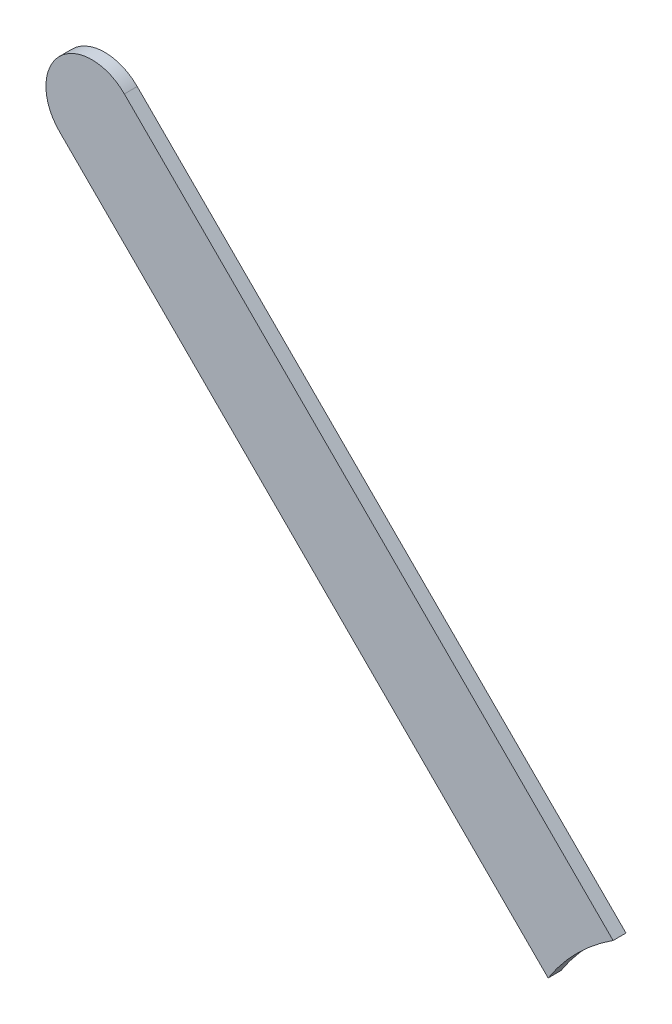
ISO-10303-21;
HEADER;
FILE_DESCRIPTION(('STEP AP214'),'2;1');
FILE_NAME('part.step','',(''),(''),'','','');
FILE_SCHEMA(('AUTOMOTIVE_DESIGN { 1 0 10303 214 1 1 1 1 }'));
ENDSEC;
DATA;
#1=APPLICATION_CONTEXT('core data for automotive mechanical design processes');
#2=APPLICATION_PROTOCOL_DEFINITION('international standard','automotive_design',2000,#1);
#3=PRODUCT_CONTEXT('',#1,'mechanical');
#4=PRODUCT('Part','Part','',(#3));
#5=PRODUCT_RELATED_PRODUCT_CATEGORY('part','',(#4));
#6=PRODUCT_DEFINITION_FORMATION('','',#4);
#7=PRODUCT_DEFINITION_CONTEXT('part definition',#1,'design');
#8=PRODUCT_DEFINITION('design','',#6,#7);
#9=PRODUCT_DEFINITION_SHAPE('','',#8);
#10=(LENGTH_UNIT() NAMED_UNIT(*) SI_UNIT(.MILLI.,.METRE.));
#11=(NAMED_UNIT(*) PLANE_ANGLE_UNIT() SI_UNIT($,.RADIAN.));
#12=(NAMED_UNIT(*) SI_UNIT($,.STERADIAN.) SOLID_ANGLE_UNIT());
#13=UNCERTAINTY_MEASURE_WITH_UNIT(LENGTH_MEASURE(1.E-05),#10,'distance_accuracy_value','');
#14=(GEOMETRIC_REPRESENTATION_CONTEXT(3) GLOBAL_UNCERTAINTY_ASSIGNED_CONTEXT((#13)) GLOBAL_UNIT_ASSIGNED_CONTEXT((#10,
#11,#12)) REPRESENTATION_CONTEXT('',''));
#15=CARTESIAN_POINT('',(0.,0.,0.));
#16=DIRECTION('',(0.,0.,1.));
#17=DIRECTION('',(1.,0.,0.));
#18=AXIS2_PLACEMENT_3D('',#15,#16,#17);
#19=CARTESIAN_POINT('',(94.64332354,105.29716812,0.));
#20=DIRECTION('',(0.707106781186548,0.707106781186548,0.));
#21=DIRECTION('',(0.707106781186548,-0.707106781186548,0.));
#22=AXIS2_PLACEMENT_3D('',#19,#20,#21);
#23=PLANE('',#22);
#24=DIRECTION('',(0.707106781186548,-0.707106781186548,0.));
#25=VECTOR('',#24,1.);
#26=CARTESIAN_POINT('',(94.64332354,105.29716812,0.03556));
#27=LINE('',#26,#25);
#28=CARTESIAN_POINT('',(94.64332354,105.29716812,0.03556));
#29=VERTEX_POINT('',#28);
#30=CARTESIAN_POINT('',(95.9945262160068,103.945965443993,0.03556));
#31=VERTEX_POINT('',#30);
#32=EDGE_CURVE('E11',#29,#31,#27,.T.);
#33=ORIENTED_EDGE('',*,*,#32,.F.);
#34=DIRECTION('',(0.,0.,1.));
#35=VECTOR('',#34,1.);
#36=CARTESIAN_POINT('',(94.64332354,105.29716812,0.));
#37=LINE('',#36,#35);
#38=CARTESIAN_POINT('',(94.64332354,105.29716812,0.));
#39=VERTEX_POINT('',#38);
#40=EDGE_CURVE('E24',#39,#29,#37,.T.);
#41=ORIENTED_EDGE('',*,*,#40,.F.);
#42=DIRECTION('',(0.707106781186548,-0.707106781186548,0.));
#43=VECTOR('',#42,1.);
#44=CARTESIAN_POINT('',(94.64332354,105.29716812,0.));
#45=LINE('',#44,#43);
#46=CARTESIAN_POINT('',(95.9945262160068,103.945965443993,0.));
#47=VERTEX_POINT('',#46);
#48=EDGE_CURVE('E75',#39,#47,#45,.T.);
#49=ORIENTED_EDGE('',*,*,#48,.T.);
#50=DIRECTION('',(0.,0.,1.));
#51=VECTOR('',#50,1.);
#52=CARTESIAN_POINT('',(95.9945262160068,103.945965443993,0.));
#53=LINE('',#52,#51);
#54=EDGE_CURVE('E37',#47,#31,#53,.T.);
#55=ORIENTED_EDGE('',*,*,#54,.T.);
#56=EDGE_LOOP('',(#33,#41,#49,#55));
#57=FACE_BOUND('',#56,.T.);
#58=ADVANCED_FACE('F17',(#57),#23,.F.);
#59=CARTESIAN_POINT('',(96.495362,103.6247356,0.));
#60=DIRECTION('',(0.,0.,-1.));
#61=DIRECTION('',(1.,0.,0.));
#62=AXIS2_PLACEMENT_3D('',#59,#60,#61);
#63=CYLINDRICAL_SURFACE('',#62,0.59500008);
#64=DIRECTION('',(0.,0.,1.));
#65=VECTOR('',#64,1.);
#66=CARTESIAN_POINT('',(96.1741321560068,104.125571383993,0.));
#67=LINE('',#66,#65);
#68=CARTESIAN_POINT('',(96.1741321560068,104.125571383993,0.));
#69=VERTEX_POINT('',#68);
#70=CARTESIAN_POINT('',(96.1741321560068,104.125571383993,0.03556));
#71=VERTEX_POINT('',#70);
#72=EDGE_CURVE('E67',#69,#71,#67,.T.);
#73=ORIENTED_EDGE('',*,*,#72,.T.);
#74=CARTESIAN_POINT('',(96.495362,103.6247356,0.03556));
#75=DIRECTION('',(0.,0.,1.));
#76=DIRECTION('',(1.,0.,0.));
#77=AXIS2_PLACEMENT_3D('',#74,#75,#76);
#78=CIRCLE('',#77,0.59500008);
#79=EDGE_CURVE('E82',#71,#31,#78,.T.);
#80=ORIENTED_EDGE('',*,*,#79,.T.);
#81=ORIENTED_EDGE('',*,*,#54,.F.);
#82=CARTESIAN_POINT('',(96.495362,103.6247356,0.));
#83=DIRECTION('',(0.,0.,1.));
#84=DIRECTION('',(1.,0.,0.));
#85=AXIS2_PLACEMENT_3D('',#82,#83,#84);
#86=CIRCLE('',#85,0.59500008);
#87=EDGE_CURVE('E80',#69,#47,#86,.T.);
#88=ORIENTED_EDGE('',*,*,#87,.F.);
#89=EDGE_LOOP('',(#73,#80,#81,#88));
#90=FACE_BOUND('',#89,.T.);
#91=ADVANCED_FACE('F88',(#90),#63,.F.);
#92=CARTESIAN_POINT('',(96.1741321560068,104.125571383993,0.));
#93=DIRECTION('',(-0.707106781186545,-0.70710678118655,0.));
#94=DIRECTION('',(-0.70710678118655,0.707106781186545,0.));
#95=AXIS2_PLACEMENT_3D('',#92,#93,#94);
#96=PLANE('',#95);
#97=DIRECTION('',(-0.70710678118655,0.707106781186545,0.));
#98=VECTOR('',#97,1.);
#99=CARTESIAN_POINT('',(96.5851637,103.71453984,0.03556));
#100=LINE('',#99,#98);
#101=CARTESIAN_POINT('',(94.82292948,105.47677406,0.03556));
#102=VERTEX_POINT('',#101);
#103=EDGE_CURVE('E71',#71,#102,#100,.T.);
#104=ORIENTED_EDGE('',*,*,#103,.F.);
#105=ORIENTED_EDGE('',*,*,#72,.F.);
#106=DIRECTION('',(-0.70710678118655,0.707106781186545,0.));
#107=VECTOR('',#106,1.);
#108=CARTESIAN_POINT('',(96.5851637,103.71453984,0.));
#109=LINE('',#108,#107);
#110=CARTESIAN_POINT('',(94.82292948,105.47677406,0.));
#111=VERTEX_POINT('',#110);
#112=EDGE_CURVE('E63',#69,#111,#109,.T.);
#113=ORIENTED_EDGE('',*,*,#112,.T.);
#114=DIRECTION('',(0.,0.,1.));
#115=VECTOR('',#114,1.);
#116=CARTESIAN_POINT('',(94.82292948,105.47677406,0.));
#117=LINE('',#116,#115);
#118=EDGE_CURVE('E53',#111,#102,#117,.T.);
#119=ORIENTED_EDGE('',*,*,#118,.T.);
#120=EDGE_LOOP('',(#104,#105,#113,#119));
#121=FACE_BOUND('',#120,.T.);
#122=ADVANCED_FACE('F66',(#121),#96,.F.);
#123=CARTESIAN_POINT('',(94.73312651,105.38697109,0.));
#124=DIRECTION('',(0.,0.,-1.));
#125=DIRECTION('',(0.707106781186548,0.707106781186548,0.));
#126=AXIS2_PLACEMENT_3D('',#123,#124,#125);
#127=CYLINDRICAL_SURFACE('',#126,0.127000578115379);
#128=CARTESIAN_POINT('',(94.73312651,105.38697109,0.03556));
#129=DIRECTION('',(0.,0.,1.));
#130=DIRECTION('',(0.707106781186548,0.707106781186548,0.));
#131=AXIS2_PLACEMENT_3D('',#128,#129,#130);
#132=CIRCLE('',#131,0.127000578115379);
#133=EDGE_CURVE('E59',#102,#29,#132,.T.);
#134=ORIENTED_EDGE('',*,*,#133,.F.);
#135=ORIENTED_EDGE('',*,*,#118,.F.);
#136=CARTESIAN_POINT('',(94.73312651,105.38697109,0.));
#137=DIRECTION('',(0.,0.,1.));
#138=DIRECTION('',(0.707106781186548,0.707106781186548,0.));
#139=AXIS2_PLACEMENT_3D('',#136,#137,#138);
#140=CIRCLE('',#139,0.127000578115379);
#141=EDGE_CURVE('E57',#111,#39,#140,.T.);
#142=ORIENTED_EDGE('',*,*,#141,.T.);
#143=ORIENTED_EDGE('',*,*,#40,.T.);
#144=EDGE_LOOP('',(#134,#135,#142,#143));
#145=FACE_BOUND('',#144,.T.);
#146=ADVANCED_FACE('F55',(#145),#127,.T.);
#147=CARTESIAN_POINT('',(94.64332354,105.29716812,0.));
#148=DIRECTION('',(0.,0.,-1.));
#149=DIRECTION('',(-1.,0.,0.));
#150=AXIS2_PLACEMENT_3D('',#147,#148,#149);
#151=PLANE('',#150);
#152=ORIENTED_EDGE('',*,*,#48,.F.);
#153=ORIENTED_EDGE('',*,*,#141,.F.);
#154=ORIENTED_EDGE('',*,*,#112,.F.);
#155=ORIENTED_EDGE('',*,*,#87,.T.);
#156=EDGE_LOOP('',(#152,#153,#154,#155));
#157=FACE_BOUND('',#156,.T.);
#158=ADVANCED_FACE('F74',(#157),#151,.T.);
#159=CARTESIAN_POINT('',(94.64332354,105.29716812,0.03556));
#160=DIRECTION('',(0.,0.,-1.));
#161=DIRECTION('',(-1.,0.,0.));
#162=AXIS2_PLACEMENT_3D('',#159,#160,#161);
#163=PLANE('',#162);
#164=ORIENTED_EDGE('',*,*,#133,.T.);
#165=ORIENTED_EDGE('',*,*,#32,.T.);
#166=ORIENTED_EDGE('',*,*,#79,.F.);
#167=ORIENTED_EDGE('',*,*,#103,.T.);
#168=EDGE_LOOP('',(#164,#165,#166,#167));
#169=FACE_BOUND('',#168,.T.);
#170=ADVANCED_FACE('F91',(#169),#163,.F.);
#171=CLOSED_SHELL('',(#58,#91,#122,#146,#158,#170));
#172=MANIFOLD_SOLID_BREP('B1',#171);
#173=ADVANCED_BREP_SHAPE_REPRESENTATION('',(#18,#172),#14);
#174=SHAPE_DEFINITION_REPRESENTATION(#9,#173);
ENDSEC;
END-ISO-10303-21;
